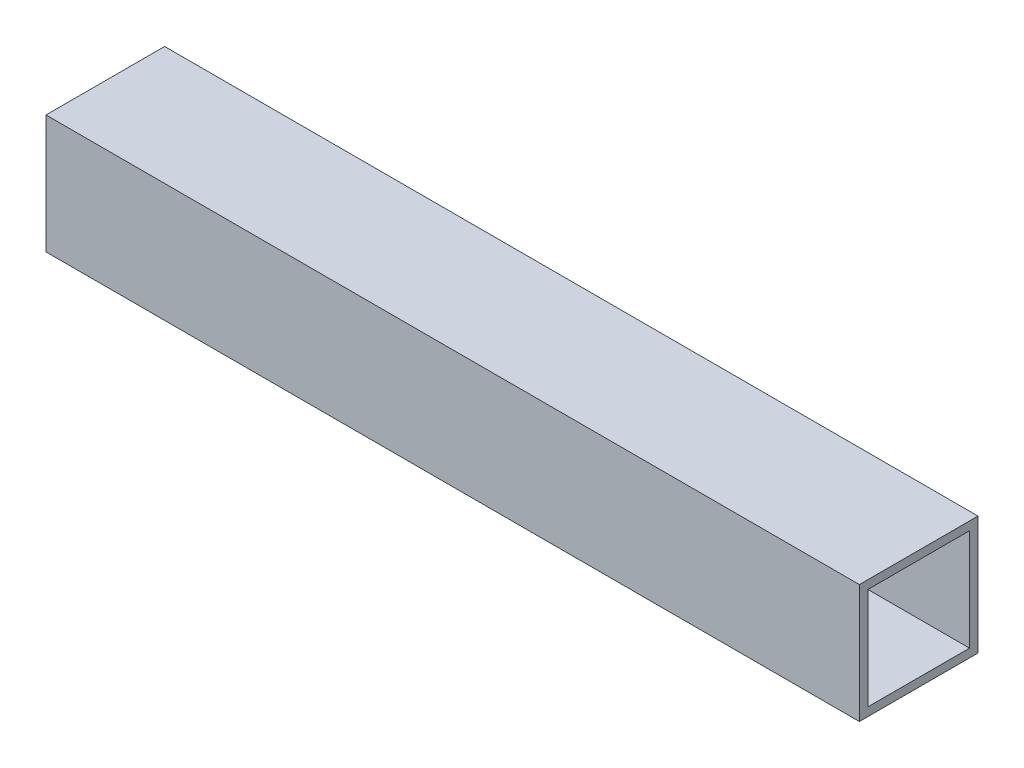
ISO-10303-21;
HEADER;
FILE_DESCRIPTION(('STEP AP214'),'2;1');
FILE_NAME('part.step','',(''),(''),'','','');
FILE_SCHEMA(('AUTOMOTIVE_DESIGN { 1 0 10303 214 1 1 1 1 }'));
ENDSEC;
DATA;
#1=APPLICATION_CONTEXT('core data for automotive mechanical design processes');
#2=APPLICATION_PROTOCOL_DEFINITION('international standard','automotive_design',2000,#1);
#3=PRODUCT_CONTEXT('',#1,'mechanical');
#4=PRODUCT('Part','Part','',(#3));
#5=PRODUCT_RELATED_PRODUCT_CATEGORY('part','',(#4));
#6=PRODUCT_DEFINITION_FORMATION('','',#4);
#7=PRODUCT_DEFINITION_CONTEXT('part definition',#1,'design');
#8=PRODUCT_DEFINITION('design','',#6,#7);
#9=PRODUCT_DEFINITION_SHAPE('','',#8);
#10=(LENGTH_UNIT() NAMED_UNIT(*) SI_UNIT(.MILLI.,.METRE.));
#11=(NAMED_UNIT(*) PLANE_ANGLE_UNIT() SI_UNIT($,.RADIAN.));
#12=(NAMED_UNIT(*) SI_UNIT($,.STERADIAN.) SOLID_ANGLE_UNIT());
#13=UNCERTAINTY_MEASURE_WITH_UNIT(LENGTH_MEASURE(1.E-05),#10,'distance_accuracy_value','');
#14=(GEOMETRIC_REPRESENTATION_CONTEXT(3) GLOBAL_UNCERTAINTY_ASSIGNED_CONTEXT((#13)) GLOBAL_UNIT_ASSIGNED_CONTEXT((#10,
#11,#12)) REPRESENTATION_CONTEXT('',''));
#15=CARTESIAN_POINT('',(0.,0.,0.));
#16=DIRECTION('',(0.,0.,1.));
#17=DIRECTION('',(1.,0.,0.));
#18=AXIS2_PLACEMENT_3D('',#15,#16,#17);
#19=CARTESIAN_POINT('',(-152.4,-22.225,22.225));
#20=DIRECTION('',(0.,-1.,0.));
#21=DIRECTION('',(0.,0.,-1.));
#22=AXIS2_PLACEMENT_3D('',#19,#20,#21);
#23=PLANE('',#22);
#24=DIRECTION('',(1.,0.,0.));
#25=VECTOR('',#24,1.);
#26=CARTESIAN_POINT('',(-152.4,-22.225,22.225));
#27=LINE('',#26,#25);
#28=CARTESIAN_POINT('',(-152.4,-22.225,22.225));
#29=VERTEX_POINT('',#28);
#30=CARTESIAN_POINT('',(152.4,-22.225,22.225));
#31=VERTEX_POINT('',#30);
#32=EDGE_CURVE('E114',#29,#31,#27,.T.);
#33=ORIENTED_EDGE('',*,*,#32,.F.);
#34=DIRECTION('',(0.,0.,-1.));
#35=VECTOR('',#34,1.);
#36=CARTESIAN_POINT('',(-152.4,-22.225,0.));
#37=LINE('',#36,#35);
#38=CARTESIAN_POINT('',(-152.4,-22.225,-22.225));
#39=VERTEX_POINT('',#38);
#40=EDGE_CURVE('E136',#29,#39,#37,.T.);
#41=ORIENTED_EDGE('',*,*,#40,.T.);
#42=DIRECTION('',(-1.,0.,0.));
#43=VECTOR('',#42,1.);
#44=CARTESIAN_POINT('',(-152.4,-22.225,-22.225));
#45=LINE('',#44,#43);
#46=CARTESIAN_POINT('',(152.4,-22.225,-22.225));
#47=VERTEX_POINT('',#46);
#48=EDGE_CURVE('E131',#47,#39,#45,.T.);
#49=ORIENTED_EDGE('',*,*,#48,.F.);
#50=DIRECTION('',(0.,0.,-1.));
#51=VECTOR('',#50,1.);
#52=CARTESIAN_POINT('',(152.4,-22.225,0.));
#53=LINE('',#52,#51);
#54=EDGE_CURVE('E106',#31,#47,#53,.T.);
#55=ORIENTED_EDGE('',*,*,#54,.F.);
#56=EDGE_LOOP('',(#33,#41,#49,#55));
#57=FACE_BOUND('',#56,.T.);
#58=ADVANCED_FACE('F17',(#57),#23,.T.);
#59=CARTESIAN_POINT('',(-152.4,19.05,-19.05));
#60=DIRECTION('',(0.,0.,1.));
#61=DIRECTION('',(1.,0.,0.));
#62=AXIS2_PLACEMENT_3D('',#59,#60,#61);
#63=PLANE('',#62);
#64=DIRECTION('',(1.,0.,0.));
#65=VECTOR('',#64,1.);
#66=CARTESIAN_POINT('',(-152.4,19.05,-19.05));
#67=LINE('',#66,#65);
#68=CARTESIAN_POINT('',(-152.4,19.05,-19.05));
#69=VERTEX_POINT('',#68);
#70=CARTESIAN_POINT('',(152.4,19.05,-19.05));
#71=VERTEX_POINT('',#70);
#72=EDGE_CURVE('E91',#69,#71,#67,.T.);
#73=ORIENTED_EDGE('',*,*,#72,.F.);
#74=DIRECTION('',(0.,1.,0.));
#75=VECTOR('',#74,1.);
#76=CARTESIAN_POINT('',(-152.4,0.,-19.05));
#77=LINE('',#76,#75);
#78=CARTESIAN_POINT('',(-152.4,-19.05,-19.05));
#79=VERTEX_POINT('',#78);
#80=EDGE_CURVE('E139',#69,#79,#77,.F.);
#81=ORIENTED_EDGE('',*,*,#80,.T.);
#82=DIRECTION('',(1.,0.,0.));
#83=VECTOR('',#82,1.);
#84=CARTESIAN_POINT('',(-152.4,-19.05,-19.05));
#85=LINE('',#84,#83);
#86=CARTESIAN_POINT('',(152.4,-19.05,-19.05));
#87=VERTEX_POINT('',#86);
#88=EDGE_CURVE('E20',#87,#79,#85,.F.);
#89=ORIENTED_EDGE('',*,*,#88,.F.);
#90=DIRECTION('',(0.,1.,0.));
#91=VECTOR('',#90,1.);
#92=CARTESIAN_POINT('',(152.4,0.,-19.05));
#93=LINE('',#92,#91);
#94=EDGE_CURVE('E105',#71,#87,#93,.F.);
#95=ORIENTED_EDGE('',*,*,#94,.F.);
#96=EDGE_LOOP('',(#73,#81,#89,#95));
#97=FACE_BOUND('',#96,.T.);
#98=ADVANCED_FACE('F125',(#97),#63,.T.);
#99=CARTESIAN_POINT('',(-152.4,-19.05,-19.05));
#100=DIRECTION('',(0.,1.,0.));
#101=DIRECTION('',(0.,0.,1.));
#102=AXIS2_PLACEMENT_3D('',#99,#100,#101);
#103=PLANE('',#102);
#104=ORIENTED_EDGE('',*,*,#88,.T.);
#105=DIRECTION('',(0.,0.,-1.));
#106=VECTOR('',#105,1.);
#107=CARTESIAN_POINT('',(-152.4,-19.05,0.));
#108=LINE('',#107,#106);
#109=CARTESIAN_POINT('',(-152.4,-19.05,19.05));
#110=VERTEX_POINT('',#109);
#111=EDGE_CURVE('E88',#79,#110,#108,.F.);
#112=ORIENTED_EDGE('',*,*,#111,.T.);
#113=DIRECTION('',(-1.,0.,0.));
#114=VECTOR('',#113,1.);
#115=CARTESIAN_POINT('',(-152.4,-19.05,19.05));
#116=LINE('',#115,#114);
#117=CARTESIAN_POINT('',(152.4,-19.05,19.05));
#118=VERTEX_POINT('',#117);
#119=EDGE_CURVE('E80',#118,#110,#116,.T.);
#120=ORIENTED_EDGE('',*,*,#119,.F.);
#121=DIRECTION('',(0.,0.,-1.));
#122=VECTOR('',#121,1.);
#123=CARTESIAN_POINT('',(152.4,-19.05,0.));
#124=LINE('',#123,#122);
#125=EDGE_CURVE('E85',#87,#118,#124,.F.);
#126=ORIENTED_EDGE('',*,*,#125,.F.);
#127=EDGE_LOOP('',(#104,#112,#120,#126));
#128=FACE_BOUND('',#127,.T.);
#129=ADVANCED_FACE('F83',(#128),#103,.T.);
#130=CARTESIAN_POINT('',(-152.4,-19.05,19.05));
#131=DIRECTION('',(0.,0.,-1.));
#132=DIRECTION('',(-1.,0.,0.));
#133=AXIS2_PLACEMENT_3D('',#130,#131,#132);
#134=PLANE('',#133);
#135=ORIENTED_EDGE('',*,*,#119,.T.);
#136=DIRECTION('',(0.,1.,0.));
#137=VECTOR('',#136,1.);
#138=CARTESIAN_POINT('',(-152.4,0.,19.05));
#139=LINE('',#138,#137);
#140=CARTESIAN_POINT('',(-152.4,19.05,19.05));
#141=VERTEX_POINT('',#140);
#142=EDGE_CURVE('E142',#110,#141,#139,.T.);
#143=ORIENTED_EDGE('',*,*,#142,.T.);
#144=DIRECTION('',(1.,0.,0.));
#145=VECTOR('',#144,1.);
#146=CARTESIAN_POINT('',(-152.4,19.05,19.05));
#147=LINE('',#146,#145);
#148=CARTESIAN_POINT('',(152.4,19.05,19.05));
#149=VERTEX_POINT('',#148);
#150=EDGE_CURVE('E96',#149,#141,#147,.F.);
#151=ORIENTED_EDGE('',*,*,#150,.F.);
#152=DIRECTION('',(0.,1.,0.));
#153=VECTOR('',#152,1.);
#154=CARTESIAN_POINT('',(152.4,0.,19.05));
#155=LINE('',#154,#153);
#156=EDGE_CURVE('E93',#118,#149,#155,.T.);
#157=ORIENTED_EDGE('',*,*,#156,.F.);
#158=EDGE_LOOP('',(#135,#143,#151,#157));
#159=FACE_BOUND('',#158,.T.);
#160=ADVANCED_FACE('F94',(#159),#134,.T.);
#161=CARTESIAN_POINT('',(-152.4,19.05,19.05));
#162=DIRECTION('',(0.,-1.,0.));
#163=DIRECTION('',(0.,0.,-1.));
#164=AXIS2_PLACEMENT_3D('',#161,#162,#163);
#165=PLANE('',#164);
#166=ORIENTED_EDGE('',*,*,#150,.T.);
#167=DIRECTION('',(0.,0.,-1.));
#168=VECTOR('',#167,1.);
#169=CARTESIAN_POINT('',(-152.4,19.05,0.));
#170=LINE('',#169,#168);
#171=EDGE_CURVE('E122',#141,#69,#170,.T.);
#172=ORIENTED_EDGE('',*,*,#171,.T.);
#173=ORIENTED_EDGE('',*,*,#72,.T.);
#174=DIRECTION('',(0.,0.,-1.));
#175=VECTOR('',#174,1.);
#176=CARTESIAN_POINT('',(152.4,19.05,0.));
#177=LINE('',#176,#175);
#178=EDGE_CURVE('E100',#149,#71,#177,.T.);
#179=ORIENTED_EDGE('',*,*,#178,.F.);
#180=EDGE_LOOP('',(#166,#172,#173,#179));
#181=FACE_BOUND('',#180,.T.);
#182=ADVANCED_FACE('F120',(#181),#165,.T.);
#183=CARTESIAN_POINT('',(-152.4,22.225,22.225));
#184=DIRECTION('',(0.,0.,1.));
#185=DIRECTION('',(1.,0.,0.));
#186=AXIS2_PLACEMENT_3D('',#183,#184,#185);
#187=PLANE('',#186);
#188=DIRECTION('',(1.,0.,0.));
#189=VECTOR('',#188,1.);
#190=CARTESIAN_POINT('',(-152.4,22.225,22.225));
#191=LINE('',#190,#189);
#192=CARTESIAN_POINT('',(-152.4,22.225,22.225));
#193=VERTEX_POINT('',#192);
#194=CARTESIAN_POINT('',(152.4,22.225,22.225));
#195=VERTEX_POINT('',#194);
#196=EDGE_CURVE('E145',#193,#195,#191,.T.);
#197=ORIENTED_EDGE('',*,*,#196,.F.);
#198=DIRECTION('',(0.,1.,0.));
#199=VECTOR('',#198,1.);
#200=CARTESIAN_POINT('',(-152.4,0.,22.225));
#201=LINE('',#200,#199);
#202=EDGE_CURVE('E133',#193,#29,#201,.F.);
#203=ORIENTED_EDGE('',*,*,#202,.T.);
#204=ORIENTED_EDGE('',*,*,#32,.T.);
#205=DIRECTION('',(0.,1.,0.));
#206=VECTOR('',#205,1.);
#207=CARTESIAN_POINT('',(152.4,0.,22.225));
#208=LINE('',#207,#206);
#209=EDGE_CURVE('E108',#195,#31,#208,.F.);
#210=ORIENTED_EDGE('',*,*,#209,.F.);
#211=EDGE_LOOP('',(#197,#203,#204,#210));
#212=FACE_BOUND('',#211,.T.);
#213=ADVANCED_FACE('F164',(#212),#187,.T.);
#214=CARTESIAN_POINT('',(152.4,0.,0.));
#215=DIRECTION('',(1.,0.,0.));
#216=DIRECTION('',(0.,0.,-1.));
#217=AXIS2_PLACEMENT_3D('',#214,#215,#216);
#218=PLANE('',#217);
#219=ORIENTED_EDGE('',*,*,#178,.T.);
#220=ORIENTED_EDGE('',*,*,#94,.T.);
#221=ORIENTED_EDGE('',*,*,#125,.T.);
#222=ORIENTED_EDGE('',*,*,#156,.T.);
#223=EDGE_LOOP('',(#219,#220,#221,#222));
#224=FACE_BOUND('',#223,.T.);
#225=DIRECTION('',(0.,1.,0.));
#226=VECTOR('',#225,1.);
#227=CARTESIAN_POINT('',(152.4,-22.225,-22.225));
#228=LINE('',#227,#226);
#229=CARTESIAN_POINT('',(152.4,22.225,-22.225));
#230=VERTEX_POINT('',#229);
#231=EDGE_CURVE('E126',#230,#47,#228,.F.);
#232=ORIENTED_EDGE('',*,*,#231,.F.);
#233=DIRECTION('',(0.,0.,1.));
#234=VECTOR('',#233,1.);
#235=CARTESIAN_POINT('',(152.4,22.225,-22.225));
#236=LINE('',#235,#234);
#237=EDGE_CURVE('E148',#195,#230,#236,.F.);
#238=ORIENTED_EDGE('',*,*,#237,.F.);
#239=ORIENTED_EDGE('',*,*,#209,.T.);
#240=ORIENTED_EDGE('',*,*,#54,.T.);
#241=EDGE_LOOP('',(#232,#238,#239,#240));
#242=FACE_BOUND('',#241,.T.);
#243=ADVANCED_FACE('F102',(#224,#242),#218,.T.);
#244=CARTESIAN_POINT('',(-152.4,-22.225,-22.225));
#245=DIRECTION('',(0.,0.,-1.));
#246=DIRECTION('',(-1.,0.,0.));
#247=AXIS2_PLACEMENT_3D('',#244,#245,#246);
#248=PLANE('',#247);
#249=ORIENTED_EDGE('',*,*,#48,.T.);
#250=DIRECTION('',(0.,1.,0.));
#251=VECTOR('',#250,1.);
#252=CARTESIAN_POINT('',(-152.4,0.,-22.225));
#253=LINE('',#252,#251);
#254=CARTESIAN_POINT('',(-152.4,22.225,-22.225));
#255=VERTEX_POINT('',#254);
#256=EDGE_CURVE('E35',#39,#255,#253,.T.);
#257=ORIENTED_EDGE('',*,*,#256,.T.);
#258=DIRECTION('',(1.,0.,0.));
#259=VECTOR('',#258,1.);
#260=CARTESIAN_POINT('',(-152.4,22.225,-22.225));
#261=LINE('',#260,#259);
#262=EDGE_CURVE('E26',#230,#255,#261,.F.);
#263=ORIENTED_EDGE('',*,*,#262,.F.);
#264=ORIENTED_EDGE('',*,*,#231,.T.);
#265=EDGE_LOOP('',(#249,#257,#263,#264));
#266=FACE_BOUND('',#265,.T.);
#267=ADVANCED_FACE('F155',(#266),#248,.T.);
#268=CARTESIAN_POINT('',(-152.4,0.,0.));
#269=DIRECTION('',(1.,0.,0.));
#270=DIRECTION('',(0.,0.,-1.));
#271=AXIS2_PLACEMENT_3D('',#268,#269,#270);
#272=PLANE('',#271);
#273=ORIENTED_EDGE('',*,*,#142,.F.);
#274=ORIENTED_EDGE('',*,*,#111,.F.);
#275=ORIENTED_EDGE('',*,*,#80,.F.);
#276=ORIENTED_EDGE('',*,*,#171,.F.);
#277=EDGE_LOOP('',(#273,#274,#275,#276));
#278=FACE_BOUND('',#277,.T.);
#279=ORIENTED_EDGE('',*,*,#40,.F.);
#280=ORIENTED_EDGE('',*,*,#202,.F.);
#281=DIRECTION('',(0.,0.,1.));
#282=VECTOR('',#281,1.);
#283=CARTESIAN_POINT('',(-152.4,22.225,-22.225));
#284=LINE('',#283,#282);
#285=EDGE_CURVE('E11',#255,#193,#284,.T.);
#286=ORIENTED_EDGE('',*,*,#285,.F.);
#287=ORIENTED_EDGE('',*,*,#256,.F.);
#288=EDGE_LOOP('',(#279,#280,#286,#287));
#289=FACE_BOUND('',#288,.T.);
#290=ADVANCED_FACE('F162',(#278,#289),#272,.F.);
#291=CARTESIAN_POINT('',(-152.4,22.225,-22.225));
#292=DIRECTION('',(0.,1.,0.));
#293=DIRECTION('',(0.,0.,1.));
#294=AXIS2_PLACEMENT_3D('',#291,#292,#293);
#295=PLANE('',#294);
#296=ORIENTED_EDGE('',*,*,#262,.T.);
#297=ORIENTED_EDGE('',*,*,#285,.T.);
#298=ORIENTED_EDGE('',*,*,#196,.T.);
#299=ORIENTED_EDGE('',*,*,#237,.T.);
#300=EDGE_LOOP('',(#296,#297,#298,#299));
#301=FACE_BOUND('',#300,.T.);
#302=ADVANCED_FACE('F153',(#301),#295,.T.);
#303=CLOSED_SHELL('',(#58,#98,#129,#160,#182,#213,#243,#267,#290,#302));
#304=MANIFOLD_SOLID_BREP('B1',#303);
#305=ADVANCED_BREP_SHAPE_REPRESENTATION('',(#18,#304),#14);
#306=SHAPE_DEFINITION_REPRESENTATION(#9,#305);
ENDSEC;
END-ISO-10303-21;
